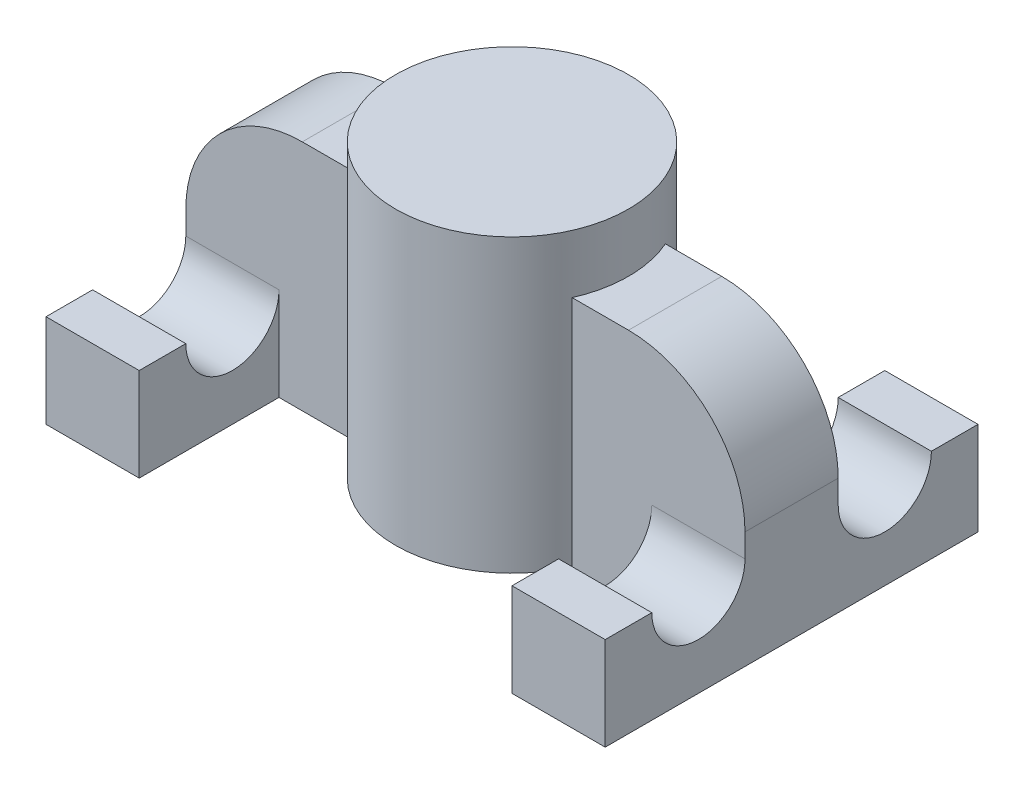
ISO-10303-21;
HEADER;
FILE_DESCRIPTION(('STEP AP214'),'2;1');
FILE_NAME('part.step','',(''),(''),'','','');
FILE_SCHEMA(('AUTOMOTIVE_DESIGN { 1 0 10303 214 1 1 1 1 }'));
ENDSEC;
DATA;
#1=APPLICATION_CONTEXT('core data for automotive mechanical design processes');
#2=APPLICATION_PROTOCOL_DEFINITION('international standard','automotive_design',2000,#1);
#3=PRODUCT_CONTEXT('',#1,'mechanical');
#4=PRODUCT('Part','Part','',(#3));
#5=PRODUCT_RELATED_PRODUCT_CATEGORY('part','',(#4));
#6=PRODUCT_DEFINITION_FORMATION('','',#4);
#7=PRODUCT_DEFINITION_CONTEXT('part definition',#1,'design');
#8=PRODUCT_DEFINITION('design','',#6,#7);
#9=PRODUCT_DEFINITION_SHAPE('','',#8);
#10=(LENGTH_UNIT() NAMED_UNIT(*) SI_UNIT(.MILLI.,.METRE.));
#11=(NAMED_UNIT(*) PLANE_ANGLE_UNIT() SI_UNIT($,.RADIAN.));
#12=(NAMED_UNIT(*) SI_UNIT($,.STERADIAN.) SOLID_ANGLE_UNIT());
#13=UNCERTAINTY_MEASURE_WITH_UNIT(LENGTH_MEASURE(1.E-05),#10,'distance_accuracy_value','');
#14=(GEOMETRIC_REPRESENTATION_CONTEXT(3) GLOBAL_UNCERTAINTY_ASSIGNED_CONTEXT((#13)) GLOBAL_UNIT_ASSIGNED_CONTEXT((#10,
#11,#12)) REPRESENTATION_CONTEXT('',''));
#15=CARTESIAN_POINT('',(0.,0.,0.));
#16=DIRECTION('',(0.,0.,1.));
#17=DIRECTION('',(1.,0.,0.));
#18=AXIS2_PLACEMENT_3D('',#15,#16,#17);
#19=CARTESIAN_POINT('',(-24.,20.,-4.));
#20=DIRECTION('',(0.,0.,-1.));
#21=DIRECTION('',(-1.,0.,0.));
#22=AXIS2_PLACEMENT_3D('',#19,#20,#21);
#23=PLANE('',#22);
#24=DIRECTION('',(0.,-1.,0.));
#25=VECTOR('',#24,1.);
#26=CARTESIAN_POINT('',(-24.,20.,-4.));
#27=LINE('',#26,#25);
#28=CARTESIAN_POINT('',(-24.,10.,-4.));
#29=VERTEX_POINT('',#28);
#30=CARTESIAN_POINT('',(-24.,8.,-4.));
#31=VERTEX_POINT('',#30);
#32=EDGE_CURVE('E363',#29,#31,#27,.T.);
#33=ORIENTED_EDGE('',*,*,#32,.F.);
#34=CARTESIAN_POINT('',(-14.,10.,-4.));
#35=DIRECTION('',(0.,0.,-1.));
#36=DIRECTION('',(-1.,0.,0.));
#37=AXIS2_PLACEMENT_3D('',#34,#35,#36);
#38=CIRCLE('',#37,10.);
#39=CARTESIAN_POINT('',(-14.,20.,-4.));
#40=VERTEX_POINT('',#39);
#41=EDGE_CURVE('E57',#29,#40,#38,.T.);
#42=ORIENTED_EDGE('',*,*,#41,.T.);
#43=DIRECTION('',(1.,0.,0.));
#44=VECTOR('',#43,1.);
#45=CARTESIAN_POINT('',(-24.,20.,-4.));
#46=LINE('',#45,#44);
#47=CARTESIAN_POINT('',(-9.16515138991168,20.,-4.));
#48=VERTEX_POINT('',#47);
#49=EDGE_CURVE('E357',#40,#48,#46,.T.);
#50=ORIENTED_EDGE('',*,*,#49,.T.);
#51=DIRECTION('',(0.,-1.,0.));
#52=VECTOR('',#51,1.);
#53=CARTESIAN_POINT('',(-9.16515138991168,25.,-4.));
#54=LINE('',#53,#52);
#55=CARTESIAN_POINT('',(-9.16515138991168,0.,-4.));
#56=VERTEX_POINT('',#55);
#57=EDGE_CURVE('E375',#56,#48,#54,.F.);
#58=ORIENTED_EDGE('',*,*,#57,.F.);
#59=DIRECTION('',(1.,0.,0.));
#60=VECTOR('',#59,1.);
#61=CARTESIAN_POINT('',(-24.,0.,-4.));
#62=LINE('',#61,#60);
#63=CARTESIAN_POINT('',(-16.,0.,-4.));
#64=VERTEX_POINT('',#63);
#65=EDGE_CURVE('E366',#64,#56,#62,.T.);
#66=ORIENTED_EDGE('',*,*,#65,.F.);
#67=DIRECTION('',(0.,-1.,0.));
#68=VECTOR('',#67,1.);
#69=CARTESIAN_POINT('',(-16.,8.,-4.));
#70=LINE('',#69,#68);
#71=CARTESIAN_POINT('',(-16.,8.,-4.));
#72=VERTEX_POINT('',#71);
#73=EDGE_CURVE('E230',#72,#64,#70,.T.);
#74=ORIENTED_EDGE('',*,*,#73,.F.);
#75=DIRECTION('',(-1.,0.,0.));
#76=VECTOR('',#75,1.);
#77=CARTESIAN_POINT('',(-16.,8.,-4.));
#78=LINE('',#77,#76);
#79=EDGE_CURVE('E234',#72,#31,#78,.T.);
#80=ORIENTED_EDGE('',*,*,#79,.T.);
#81=EDGE_LOOP('',(#33,#42,#50,#58,#66,#74,#80));
#82=FACE_BOUND('',#81,.T.);
#83=ADVANCED_FACE('F35',(#82),#23,.T.);
#84=CARTESIAN_POINT('',(9.16515138991168,20.,-4.));
#85=VERTEX_POINT('',#84);
#86=CARTESIAN_POINT('',(14.,20.,-4.));
#87=VERTEX_POINT('',#86);
#88=EDGE_CURVE('E360',#85,#87,#46,.T.);
#89=ORIENTED_EDGE('',*,*,#88,.T.);
#90=CARTESIAN_POINT('',(14.,10.,-4.));
#91=DIRECTION('',(0.,0.,-1.));
#92=DIRECTION('',(-1.,0.,0.));
#93=AXIS2_PLACEMENT_3D('',#90,#91,#92);
#94=CIRCLE('',#93,10.);
#95=CARTESIAN_POINT('',(24.,10.,-4.));
#96=VERTEX_POINT('',#95);
#97=EDGE_CURVE('E410',#87,#96,#94,.T.);
#98=ORIENTED_EDGE('',*,*,#97,.T.);
#99=DIRECTION('',(0.,-1.,0.));
#100=VECTOR('',#99,1.);
#101=CARTESIAN_POINT('',(24.,20.,-4.));
#102=LINE('',#101,#100);
#103=CARTESIAN_POINT('',(24.,8.,-4.));
#104=VERTEX_POINT('',#103);
#105=EDGE_CURVE('E378',#96,#104,#102,.T.);
#106=ORIENTED_EDGE('',*,*,#105,.T.);
#107=DIRECTION('',(1.,0.,0.));
#108=VECTOR('',#107,1.);
#109=CARTESIAN_POINT('',(16.,8.,-4.));
#110=LINE('',#109,#108);
#111=CARTESIAN_POINT('',(16.,8.,-4.));
#112=VERTEX_POINT('',#111);
#113=EDGE_CURVE('E299',#112,#104,#110,.T.);
#114=ORIENTED_EDGE('',*,*,#113,.F.);
#115=DIRECTION('',(0.,-1.,0.));
#116=VECTOR('',#115,1.);
#117=CARTESIAN_POINT('',(16.,8.,-4.));
#118=LINE('',#117,#116);
#119=CARTESIAN_POINT('',(16.,0.,-4.));
#120=VERTEX_POINT('',#119);
#121=EDGE_CURVE('E287',#112,#120,#118,.T.);
#122=ORIENTED_EDGE('',*,*,#121,.T.);
#123=CARTESIAN_POINT('',(9.16515138991168,0.,-4.));
#124=VERTEX_POINT('',#123);
#125=EDGE_CURVE('E365',#124,#120,#62,.T.);
#126=ORIENTED_EDGE('',*,*,#125,.F.);
#127=DIRECTION('',(0.,-1.,0.));
#128=VECTOR('',#127,1.);
#129=CARTESIAN_POINT('',(9.16515138991168,25.,-4.));
#130=LINE('',#129,#128);
#131=EDGE_CURVE('E383',#85,#124,#130,.T.);
#132=ORIENTED_EDGE('',*,*,#131,.F.);
#133=EDGE_LOOP('',(#89,#98,#106,#114,#122,#126,#132));
#134=FACE_BOUND('',#133,.T.);
#135=ADVANCED_FACE('F461',(#134),#23,.T.);
#136=CARTESIAN_POINT('',(0.,25.,0.));
#137=DIRECTION('',(0.,-1.,0.));
#138=DIRECTION('',(0.,0.,-1.));
#139=AXIS2_PLACEMENT_3D('',#136,#137,#138);
#140=CYLINDRICAL_SURFACE('',#139,10.);
#141=CARTESIAN_POINT('',(0.,0.,0.));
#142=DIRECTION('',(0.,1.,0.));
#143=DIRECTION('',(0.,0.,1.));
#144=AXIS2_PLACEMENT_3D('',#141,#142,#143);
#145=CIRCLE('',#144,10.);
#146=CARTESIAN_POINT('',(-9.16515138991168,0.,4.));
#147=VERTEX_POINT('',#146);
#148=CARTESIAN_POINT('',(9.16515138991168,0.,4.));
#149=VERTEX_POINT('',#148);
#150=EDGE_CURVE('E392',#147,#149,#145,.T.);
#151=ORIENTED_EDGE('',*,*,#150,.T.);
#152=DIRECTION('',(0.,-1.,0.));
#153=VECTOR('',#152,1.);
#154=CARTESIAN_POINT('',(9.16515138991168,25.,4.));
#155=LINE('',#154,#153);
#156=CARTESIAN_POINT('',(9.16515138991168,20.,4.));
#157=VERTEX_POINT('',#156);
#158=EDGE_CURVE('E386',#149,#157,#155,.F.);
#159=ORIENTED_EDGE('',*,*,#158,.T.);
#160=CARTESIAN_POINT('',(0.,20.,0.));
#161=DIRECTION('',(0.,-1.,0.));
#162=DIRECTION('',(0.,0.,-1.));
#163=AXIS2_PLACEMENT_3D('',#160,#161,#162);
#164=CIRCLE('',#163,10.);
#165=EDGE_CURVE('E402',#85,#157,#164,.T.);
#166=ORIENTED_EDGE('',*,*,#165,.F.);
#167=ORIENTED_EDGE('',*,*,#131,.T.);
#168=EDGE_CURVE('E397',#124,#56,#145,.T.);
#169=ORIENTED_EDGE('',*,*,#168,.T.);
#170=ORIENTED_EDGE('',*,*,#57,.T.);
#171=CARTESIAN_POINT('',(-9.16515138991168,20.,4.));
#172=VERTEX_POINT('',#171);
#173=EDGE_CURVE('E396',#172,#48,#164,.T.);
#174=ORIENTED_EDGE('',*,*,#173,.F.);
#175=DIRECTION('',(0.,-1.,0.));
#176=VECTOR('',#175,1.);
#177=CARTESIAN_POINT('',(-9.16515138991168,25.,4.));
#178=LINE('',#177,#176);
#179=EDGE_CURVE('E389',#172,#147,#178,.T.);
#180=ORIENTED_EDGE('',*,*,#179,.T.);
#181=EDGE_LOOP('',(#151,#159,#166,#167,#169,#170,#174,#180));
#182=FACE_BOUND('',#181,.T.);
#183=CARTESIAN_POINT('',(0.,25.,0.));
#184=DIRECTION('',(0.,1.,0.));
#185=DIRECTION('',(0.,0.,1.));
#186=AXIS2_PLACEMENT_3D('',#183,#184,#185);
#187=CIRCLE('',#186,10.);
#188=CARTESIAN_POINT('',(0.,25.,10.));
#189=VERTEX_POINT('',#188);
#190=EDGE_CURVE('E393',#189,#189,#187,.T.);
#191=ORIENTED_EDGE('',*,*,#190,.F.);
#192=EDGE_LOOP('',(#191));
#193=FACE_BOUND('',#192,.T.);
#194=ADVANCED_FACE('F466',(#182,#193),#140,.T.);
#195=CARTESIAN_POINT('',(0.,25.,0.));
#196=DIRECTION('',(0.,1.,0.));
#197=DIRECTION('',(0.,0.,1.));
#198=AXIS2_PLACEMENT_3D('',#195,#196,#197);
#199=PLANE('',#198);
#200=ORIENTED_EDGE('',*,*,#190,.T.);
#201=EDGE_LOOP('',(#200));
#202=FACE_BOUND('',#201,.T.);
#203=ADVANCED_FACE('F475',(#202),#199,.T.);
#204=CARTESIAN_POINT('',(0.,0.,0.));
#205=DIRECTION('',(0.,1.,0.));
#206=DIRECTION('',(0.,0.,1.));
#207=AXIS2_PLACEMENT_3D('',#204,#205,#206);
#208=PLANE('',#207);
#209=CARTESIAN_POINT('',(0.,0.,0.));
#210=DIRECTION('',(0.,-1.,0.));
#211=DIRECTION('',(0.,0.,-1.));
#212=AXIS2_PLACEMENT_3D('',#209,#210,#211);
#213=CIRCLE('',#212,6.25);
#214=CARTESIAN_POINT('',(0.,0.,-6.25));
#215=VERTEX_POINT('',#214);
#216=EDGE_CURVE('E344',#215,#215,#213,.T.);
#217=ORIENTED_EDGE('',*,*,#216,.F.);
#218=EDGE_LOOP('',(#217));
#219=FACE_BOUND('',#218,.T.);
#220=ORIENTED_EDGE('',*,*,#168,.F.);
#221=ORIENTED_EDGE('',*,*,#125,.T.);
#222=DIRECTION('',(0.,0.,-1.));
#223=VECTOR('',#222,1.);
#224=CARTESIAN_POINT('',(16.,0.,-4.));
#225=LINE('',#224,#223);
#226=CARTESIAN_POINT('',(16.,0.,-16.));
#227=VERTEX_POINT('',#226);
#228=EDGE_CURVE('E290',#120,#227,#225,.T.);
#229=ORIENTED_EDGE('',*,*,#228,.T.);
#230=DIRECTION('',(1.,0.,0.));
#231=VECTOR('',#230,1.);
#232=CARTESIAN_POINT('',(16.,0.,-16.));
#233=LINE('',#232,#231);
#234=CARTESIAN_POINT('',(24.,0.,-16.));
#235=VERTEX_POINT('',#234);
#236=EDGE_CURVE('E312',#227,#235,#233,.T.);
#237=ORIENTED_EDGE('',*,*,#236,.T.);
#238=DIRECTION('',(0.,0.,1.));
#239=VECTOR('',#238,1.);
#240=CARTESIAN_POINT('',(24.,0.,4.));
#241=LINE('',#240,#239);
#242=CARTESIAN_POINT('',(24.,0.,16.));
#243=VERTEX_POINT('',#242);
#244=EDGE_CURVE('E368',#235,#243,#241,.T.);
#245=ORIENTED_EDGE('',*,*,#244,.T.);
#246=DIRECTION('',(1.,0.,0.));
#247=VECTOR('',#246,1.);
#248=CARTESIAN_POINT('',(16.,0.,16.));
#249=LINE('',#248,#247);
#250=CARTESIAN_POINT('',(16.,0.,16.));
#251=VERTEX_POINT('',#250);
#252=EDGE_CURVE('E341',#251,#243,#249,.T.);
#253=ORIENTED_EDGE('',*,*,#252,.F.);
#254=DIRECTION('',(0.,0.,-1.));
#255=VECTOR('',#254,1.);
#256=CARTESIAN_POINT('',(16.,0.,4.));
#257=LINE('',#256,#255);
#258=CARTESIAN_POINT('',(16.,0.,4.));
#259=VERTEX_POINT('',#258);
#260=EDGE_CURVE('E330',#251,#259,#257,.T.);
#261=ORIENTED_EDGE('',*,*,#260,.T.);
#262=DIRECTION('',(-1.,0.,0.));
#263=VECTOR('',#262,1.);
#264=CARTESIAN_POINT('',(-24.,0.,4.));
#265=LINE('',#264,#263);
#266=EDGE_CURVE('E371',#259,#149,#265,.T.);
#267=ORIENTED_EDGE('',*,*,#266,.T.);
#268=ORIENTED_EDGE('',*,*,#150,.F.);
#269=CARTESIAN_POINT('',(-16.,0.,4.));
#270=VERTEX_POINT('',#269);
#271=EDGE_CURVE('E370',#147,#270,#265,.T.);
#272=ORIENTED_EDGE('',*,*,#271,.T.);
#273=DIRECTION('',(0.,0.,-1.));
#274=VECTOR('',#273,1.);
#275=CARTESIAN_POINT('',(-16.,0.,4.));
#276=LINE('',#275,#274);
#277=CARTESIAN_POINT('',(-16.,0.,16.));
#278=VERTEX_POINT('',#277);
#279=EDGE_CURVE('E256',#278,#270,#276,.T.);
#280=ORIENTED_EDGE('',*,*,#279,.F.);
#281=DIRECTION('',(-1.,0.,0.));
#282=VECTOR('',#281,1.);
#283=CARTESIAN_POINT('',(-16.,0.,16.));
#284=LINE('',#283,#282);
#285=CARTESIAN_POINT('',(-24.,0.,16.));
#286=VERTEX_POINT('',#285);
#287=EDGE_CURVE('E266',#278,#286,#284,.T.);
#288=ORIENTED_EDGE('',*,*,#287,.T.);
#289=DIRECTION('',(0.,0.,-1.));
#290=VECTOR('',#289,1.);
#291=CARTESIAN_POINT('',(-24.,0.,4.));
#292=LINE('',#291,#290);
#293=CARTESIAN_POINT('',(-24.,0.,-16.));
#294=VERTEX_POINT('',#293);
#295=EDGE_CURVE('E356',#286,#294,#292,.T.);
#296=ORIENTED_EDGE('',*,*,#295,.T.);
#297=DIRECTION('',(-1.,0.,0.));
#298=VECTOR('',#297,1.);
#299=CARTESIAN_POINT('',(-16.,0.,-16.));
#300=LINE('',#299,#298);
#301=CARTESIAN_POINT('',(-16.,0.,-16.));
#302=VERTEX_POINT('',#301);
#303=EDGE_CURVE('E249',#302,#294,#300,.T.);
#304=ORIENTED_EDGE('',*,*,#303,.F.);
#305=DIRECTION('',(0.,0.,-1.));
#306=VECTOR('',#305,1.);
#307=CARTESIAN_POINT('',(-16.,0.,-4.));
#308=LINE('',#307,#306);
#309=EDGE_CURVE('E241',#64,#302,#308,.T.);
#310=ORIENTED_EDGE('',*,*,#309,.F.);
#311=ORIENTED_EDGE('',*,*,#65,.T.);
#312=EDGE_LOOP('',(#220,#221,#229,#237,#245,#253,#261,#267,#268,#272,#280,#288,#296,#304,#310,#311));
#313=FACE_BOUND('',#312,.T.);
#314=ADVANCED_FACE('F427',(#219,#313),#208,.F.);
#315=CARTESIAN_POINT('',(-24.,20.,4.));
#316=DIRECTION('',(-1.,0.,0.));
#317=DIRECTION('',(0.,0.,1.));
#318=AXIS2_PLACEMENT_3D('',#315,#316,#317);
#319=PLANE('',#318);
#320=DIRECTION('',(0.,-1.,0.));
#321=VECTOR('',#320,1.);
#322=CARTESIAN_POINT('',(-24.,20.,4.));
#323=LINE('',#322,#321);
#324=CARTESIAN_POINT('',(-24.,10.,4.));
#325=VERTEX_POINT('',#324);
#326=CARTESIAN_POINT('',(-24.,8.,4.));
#327=VERTEX_POINT('',#326);
#328=EDGE_CURVE('E373',#325,#327,#323,.T.);
#329=ORIENTED_EDGE('',*,*,#328,.F.);
#330=DIRECTION('',(0.,0.,-1.));
#331=VECTOR('',#330,1.);
#332=CARTESIAN_POINT('',(-24.,10.,-4.));
#333=LINE('',#332,#331);
#334=EDGE_CURVE('E412',#325,#29,#333,.T.);
#335=ORIENTED_EDGE('',*,*,#334,.T.);
#336=ORIENTED_EDGE('',*,*,#32,.T.);
#337=CARTESIAN_POINT('',(-24.,8.,-8.));
#338=DIRECTION('',(-1.,0.,0.));
#339=DIRECTION('',(0.,0.,1.));
#340=AXIS2_PLACEMENT_3D('',#337,#338,#339);
#341=CIRCLE('',#340,4.);
#342=CARTESIAN_POINT('',(-24.,8.,-12.));
#343=VERTEX_POINT('',#342);
#344=EDGE_CURVE('E244',#343,#31,#341,.T.);
#345=ORIENTED_EDGE('',*,*,#344,.F.);
#346=DIRECTION('',(0.,0.,1.));
#347=VECTOR('',#346,1.);
#348=CARTESIAN_POINT('',(-24.,8.,-16.));
#349=LINE('',#348,#347);
#350=CARTESIAN_POINT('',(-24.,8.,-16.));
#351=VERTEX_POINT('',#350);
#352=EDGE_CURVE('E225',#351,#343,#349,.T.);
#353=ORIENTED_EDGE('',*,*,#352,.F.);
#354=DIRECTION('',(0.,1.,0.));
#355=VECTOR('',#354,1.);
#356=CARTESIAN_POINT('',(-24.,0.,-16.));
#357=LINE('',#356,#355);
#358=EDGE_CURVE('E236',#294,#351,#357,.T.);
#359=ORIENTED_EDGE('',*,*,#358,.F.);
#360=ORIENTED_EDGE('',*,*,#295,.F.);
#361=DIRECTION('',(0.,-1.,0.));
#362=VECTOR('',#361,1.);
#363=CARTESIAN_POINT('',(-24.,0.,16.));
#364=LINE('',#363,#362);
#365=CARTESIAN_POINT('',(-24.,8.,16.));
#366=VERTEX_POINT('',#365);
#367=EDGE_CURVE('E248',#366,#286,#364,.T.);
#368=ORIENTED_EDGE('',*,*,#367,.F.);
#369=DIRECTION('',(0.,0.,1.));
#370=VECTOR('',#369,1.);
#371=CARTESIAN_POINT('',(-24.,8.,16.));
#372=LINE('',#371,#370);
#373=CARTESIAN_POINT('',(-24.,8.,12.));
#374=VERTEX_POINT('',#373);
#375=EDGE_CURVE('E269',#374,#366,#372,.T.);
#376=ORIENTED_EDGE('',*,*,#375,.F.);
#377=CARTESIAN_POINT('',(-24.,8.,8.));
#378=DIRECTION('',(-1.,0.,0.));
#379=DIRECTION('',(0.,0.,-1.));
#380=AXIS2_PLACEMENT_3D('',#377,#378,#379);
#381=CIRCLE('',#380,4.);
#382=EDGE_CURVE('E257',#327,#374,#381,.T.);
#383=ORIENTED_EDGE('',*,*,#382,.F.);
#384=EDGE_LOOP('',(#329,#335,#336,#345,#353,#359,#360,#368,#376,#383));
#385=FACE_BOUND('',#384,.T.);
#386=ADVANCED_FACE('F418',(#385),#319,.T.);
#387=CARTESIAN_POINT('',(-24.,20.,-4.));
#388=DIRECTION('',(0.,-1.,0.));
#389=DIRECTION('',(0.,0.,-1.));
#390=AXIS2_PLACEMENT_3D('',#387,#388,#389);
#391=PLANE('',#390);
#392=ORIENTED_EDGE('',*,*,#49,.F.);
#393=DIRECTION('',(0.,0.,-1.));
#394=VECTOR('',#393,1.);
#395=CARTESIAN_POINT('',(-14.,20.,4.));
#396=LINE('',#395,#394);
#397=CARTESIAN_POINT('',(-14.,20.,4.));
#398=VERTEX_POINT('',#397);
#399=EDGE_CURVE('E43',#40,#398,#396,.F.);
#400=ORIENTED_EDGE('',*,*,#399,.T.);
#401=DIRECTION('',(-1.,0.,0.));
#402=VECTOR('',#401,1.);
#403=CARTESIAN_POINT('',(-24.,20.,4.));
#404=LINE('',#403,#402);
#405=EDGE_CURVE('E359',#172,#398,#404,.T.);
#406=ORIENTED_EDGE('',*,*,#405,.F.);
#407=ORIENTED_EDGE('',*,*,#173,.T.);
#408=EDGE_LOOP('',(#392,#400,#406,#407));
#409=FACE_BOUND('',#408,.T.);
#410=ADVANCED_FACE('F474',(#409),#391,.F.);
#411=CARTESIAN_POINT('',(-24.,20.,4.));
#412=DIRECTION('',(0.,0.,1.));
#413=DIRECTION('',(1.,0.,0.));
#414=AXIS2_PLACEMENT_3D('',#411,#412,#413);
#415=PLANE('',#414);
#416=ORIENTED_EDGE('',*,*,#405,.T.);
#417=CARTESIAN_POINT('',(-14.,10.,4.));
#418=DIRECTION('',(0.,0.,1.));
#419=DIRECTION('',(1.,0.,0.));
#420=AXIS2_PLACEMENT_3D('',#417,#418,#419);
#421=CIRCLE('',#420,10.);
#422=EDGE_CURVE('E11',#398,#325,#421,.T.);
#423=ORIENTED_EDGE('',*,*,#422,.T.);
#424=ORIENTED_EDGE('',*,*,#328,.T.);
#425=DIRECTION('',(-1.,0.,0.));
#426=VECTOR('',#425,1.);
#427=CARTESIAN_POINT('',(-16.,8.,4.));
#428=LINE('',#427,#426);
#429=CARTESIAN_POINT('',(-16.,8.,4.));
#430=VERTEX_POINT('',#429);
#431=EDGE_CURVE('E272',#430,#327,#428,.T.);
#432=ORIENTED_EDGE('',*,*,#431,.F.);
#433=DIRECTION('',(0.,1.,0.));
#434=VECTOR('',#433,1.);
#435=CARTESIAN_POINT('',(-16.,8.,4.));
#436=LINE('',#435,#434);
#437=EDGE_CURVE('E253',#270,#430,#436,.T.);
#438=ORIENTED_EDGE('',*,*,#437,.F.);
#439=ORIENTED_EDGE('',*,*,#271,.F.);
#440=ORIENTED_EDGE('',*,*,#179,.F.);
#441=EDGE_LOOP('',(#416,#423,#424,#432,#438,#439,#440));
#442=FACE_BOUND('',#441,.T.);
#443=ADVANCED_FACE('F452',(#442),#415,.T.);
#444=CARTESIAN_POINT('',(14.,20.,4.));
#445=VERTEX_POINT('',#444);
#446=EDGE_CURVE('E361',#445,#157,#404,.T.);
#447=ORIENTED_EDGE('',*,*,#446,.F.);
#448=DIRECTION('',(0.,0.,1.));
#449=VECTOR('',#448,1.);
#450=CARTESIAN_POINT('',(14.,20.,-4.));
#451=LINE('',#450,#449);
#452=EDGE_CURVE('E408',#445,#87,#451,.F.);
#453=ORIENTED_EDGE('',*,*,#452,.T.);
#454=ORIENTED_EDGE('',*,*,#88,.F.);
#455=ORIENTED_EDGE('',*,*,#165,.T.);
#456=EDGE_LOOP('',(#447,#453,#454,#455));
#457=FACE_BOUND('',#456,.T.);
#458=ADVANCED_FACE('F497',(#457),#391,.F.);
#459=DIRECTION('',(0.,-1.,0.));
#460=VECTOR('',#459,1.);
#461=CARTESIAN_POINT('',(24.,20.,4.));
#462=LINE('',#461,#460);
#463=CARTESIAN_POINT('',(24.,10.,4.));
#464=VERTEX_POINT('',#463);
#465=CARTESIAN_POINT('',(24.,8.,4.));
#466=VERTEX_POINT('',#465);
#467=EDGE_CURVE('E376',#464,#466,#462,.T.);
#468=ORIENTED_EDGE('',*,*,#467,.F.);
#469=CARTESIAN_POINT('',(14.,10.,4.));
#470=DIRECTION('',(0.,0.,1.));
#471=DIRECTION('',(1.,0.,0.));
#472=AXIS2_PLACEMENT_3D('',#469,#470,#471);
#473=CIRCLE('',#472,10.);
#474=EDGE_CURVE('E406',#464,#445,#473,.T.);
#475=ORIENTED_EDGE('',*,*,#474,.T.);
#476=ORIENTED_EDGE('',*,*,#446,.T.);
#477=ORIENTED_EDGE('',*,*,#158,.F.);
#478=ORIENTED_EDGE('',*,*,#266,.F.);
#479=DIRECTION('',(0.,1.,0.));
#480=VECTOR('',#479,1.);
#481=CARTESIAN_POINT('',(16.,8.,4.));
#482=LINE('',#481,#480);
#483=CARTESIAN_POINT('',(16.,8.,4.));
#484=VERTEX_POINT('',#483);
#485=EDGE_CURVE('E317',#259,#484,#482,.T.);
#486=ORIENTED_EDGE('',*,*,#485,.T.);
#487=DIRECTION('',(1.,0.,0.));
#488=VECTOR('',#487,1.);
#489=CARTESIAN_POINT('',(16.,8.,4.));
#490=LINE('',#489,#488);
#491=EDGE_CURVE('E333',#484,#466,#490,.T.);
#492=ORIENTED_EDGE('',*,*,#491,.T.);
#493=EDGE_LOOP('',(#468,#475,#476,#477,#478,#486,#492));
#494=FACE_BOUND('',#493,.T.);
#495=ADVANCED_FACE('F493',(#494),#415,.T.);
#496=CARTESIAN_POINT('',(24.,20.,4.));
#497=DIRECTION('',(1.,0.,0.));
#498=DIRECTION('',(0.,0.,-1.));
#499=AXIS2_PLACEMENT_3D('',#496,#497,#498);
#500=PLANE('',#499);
#501=ORIENTED_EDGE('',*,*,#105,.F.);
#502=DIRECTION('',(0.,0.,1.));
#503=VECTOR('',#502,1.);
#504=CARTESIAN_POINT('',(24.,10.,4.));
#505=LINE('',#504,#503);
#506=EDGE_CURVE('E403',#96,#464,#505,.T.);
#507=ORIENTED_EDGE('',*,*,#506,.T.);
#508=ORIENTED_EDGE('',*,*,#467,.T.);
#509=CARTESIAN_POINT('',(24.,8.,8.));
#510=DIRECTION('',(-1.,0.,0.));
#511=DIRECTION('',(0.,0.,-1.));
#512=AXIS2_PLACEMENT_3D('',#509,#510,#511);
#513=CIRCLE('',#512,4.);
#514=CARTESIAN_POINT('',(24.,8.,12.));
#515=VERTEX_POINT('',#514);
#516=EDGE_CURVE('E309',#466,#515,#513,.T.);
#517=ORIENTED_EDGE('',*,*,#516,.T.);
#518=DIRECTION('',(0.,0.,1.));
#519=VECTOR('',#518,1.);
#520=CARTESIAN_POINT('',(24.,8.,16.));
#521=LINE('',#520,#519);
#522=CARTESIAN_POINT('',(24.,8.,16.));
#523=VERTEX_POINT('',#522);
#524=EDGE_CURVE('E336',#515,#523,#521,.T.);
#525=ORIENTED_EDGE('',*,*,#524,.T.);
#526=DIRECTION('',(0.,-1.,0.));
#527=VECTOR('',#526,1.);
#528=CARTESIAN_POINT('',(24.,0.,16.));
#529=LINE('',#528,#527);
#530=EDGE_CURVE('E321',#523,#243,#529,.T.);
#531=ORIENTED_EDGE('',*,*,#530,.T.);
#532=ORIENTED_EDGE('',*,*,#244,.F.);
#533=DIRECTION('',(0.,1.,0.));
#534=VECTOR('',#533,1.);
#535=CARTESIAN_POINT('',(24.,0.,-16.));
#536=LINE('',#535,#534);
#537=CARTESIAN_POINT('',(24.,8.,-16.));
#538=VERTEX_POINT('',#537);
#539=EDGE_CURVE('E302',#235,#538,#536,.T.);
#540=ORIENTED_EDGE('',*,*,#539,.T.);
#541=DIRECTION('',(0.,0.,1.));
#542=VECTOR('',#541,1.);
#543=CARTESIAN_POINT('',(24.,8.,-16.));
#544=LINE('',#543,#542);
#545=CARTESIAN_POINT('',(24.,8.,-12.));
#546=VERTEX_POINT('',#545);
#547=EDGE_CURVE('E288',#538,#546,#544,.T.);
#548=ORIENTED_EDGE('',*,*,#547,.T.);
#549=CARTESIAN_POINT('',(24.,8.,-8.));
#550=DIRECTION('',(-1.,0.,0.));
#551=DIRECTION('',(0.,0.,1.));
#552=AXIS2_PLACEMENT_3D('',#549,#550,#551);
#553=CIRCLE('',#552,4.);
#554=EDGE_CURVE('E275',#546,#104,#553,.T.);
#555=ORIENTED_EDGE('',*,*,#554,.T.);
#556=EDGE_LOOP('',(#501,#507,#508,#517,#525,#531,#532,#540,#548,#555));
#557=FACE_BOUND('',#556,.T.);
#558=ADVANCED_FACE('F470',(#557),#500,.T.);
#559=CARTESIAN_POINT('',(0.,15.,0.));
#560=DIRECTION('',(0.,-1.,0.));
#561=DIRECTION('',(0.,0.,-1.));
#562=AXIS2_PLACEMENT_3D('',#559,#560,#561);
#563=CONICAL_SURFACE('',#562,6.25,0.78539816339745);
#564=CARTESIAN_POINT('',(0.,21.25,0.));
#565=VERTEX_POINT('',#564);
#566=VERTEX_LOOP('',#565);
#567=FACE_BOUND('',#566,.T.);
#568=CARTESIAN_POINT('',(0.,15.,0.));
#569=DIRECTION('',(0.,-1.,0.));
#570=DIRECTION('',(0.,0.,-1.));
#571=AXIS2_PLACEMENT_3D('',#568,#569,#570);
#572=CIRCLE('',#571,6.25);
#573=CARTESIAN_POINT('',(0.,15.,-6.25));
#574=VERTEX_POINT('',#573);
#575=EDGE_CURVE('E353',#574,#574,#572,.T.);
#576=ORIENTED_EDGE('',*,*,#575,.T.);
#577=EDGE_LOOP('',(#576));
#578=FACE_BOUND('',#577,.T.);
#579=ADVANCED_FACE('F532',(#567,#578),#563,.F.);
#580=CARTESIAN_POINT('',(0.,0.,0.));
#581=DIRECTION('',(0.,-1.,0.));
#582=DIRECTION('',(0.,0.,-1.));
#583=AXIS2_PLACEMENT_3D('',#580,#581,#582);
#584=CYLINDRICAL_SURFACE('',#583,6.25);
#585=ORIENTED_EDGE('',*,*,#575,.F.);
#586=EDGE_LOOP('',(#585));
#587=FACE_BOUND('',#586,.T.);
#588=ORIENTED_EDGE('',*,*,#216,.T.);
#589=EDGE_LOOP('',(#588));
#590=FACE_BOUND('',#589,.T.);
#591=ADVANCED_FACE('F536',(#587,#590),#584,.F.);
#592=CARTESIAN_POINT('',(16.,0.,16.));
#593=DIRECTION('',(0.,0.,1.));
#594=DIRECTION('',(1.,0.,0.));
#595=AXIS2_PLACEMENT_3D('',#592,#593,#594);
#596=PLANE('',#595);
#597=ORIENTED_EDGE('',*,*,#530,.F.);
#598=DIRECTION('',(1.,0.,0.));
#599=VECTOR('',#598,1.);
#600=CARTESIAN_POINT('',(16.,8.,16.));
#601=LINE('',#600,#599);
#602=CARTESIAN_POINT('',(16.,8.,16.));
#603=VERTEX_POINT('',#602);
#604=EDGE_CURVE('E345',#603,#523,#601,.T.);
#605=ORIENTED_EDGE('',*,*,#604,.F.);
#606=DIRECTION('',(0.,-1.,0.));
#607=VECTOR('',#606,1.);
#608=CARTESIAN_POINT('',(16.,0.,16.));
#609=LINE('',#608,#607);
#610=EDGE_CURVE('E327',#603,#251,#609,.T.);
#611=ORIENTED_EDGE('',*,*,#610,.T.);
#612=ORIENTED_EDGE('',*,*,#252,.T.);
#613=EDGE_LOOP('',(#597,#605,#611,#612));
#614=FACE_BOUND('',#613,.T.);
#615=ADVANCED_FACE('F541',(#614),#596,.T.);
#616=CARTESIAN_POINT('',(16.,8.,16.));
#617=DIRECTION('',(0.,1.,0.));
#618=DIRECTION('',(0.,0.,1.));
#619=AXIS2_PLACEMENT_3D('',#616,#617,#618);
#620=PLANE('',#619);
#621=ORIENTED_EDGE('',*,*,#524,.F.);
#622=DIRECTION('',(1.,0.,0.));
#623=VECTOR('',#622,1.);
#624=CARTESIAN_POINT('',(16.,8.,12.));
#625=LINE('',#624,#623);
#626=CARTESIAN_POINT('',(16.,8.,12.));
#627=VERTEX_POINT('',#626);
#628=EDGE_CURVE('E347',#627,#515,#625,.T.);
#629=ORIENTED_EDGE('',*,*,#628,.F.);
#630=DIRECTION('',(0.,0.,1.));
#631=VECTOR('',#630,1.);
#632=CARTESIAN_POINT('',(16.,8.,16.));
#633=LINE('',#632,#631);
#634=EDGE_CURVE('E324',#627,#603,#633,.T.);
#635=ORIENTED_EDGE('',*,*,#634,.T.);
#636=ORIENTED_EDGE('',*,*,#604,.T.);
#637=EDGE_LOOP('',(#621,#629,#635,#636));
#638=FACE_BOUND('',#637,.T.);
#639=ADVANCED_FACE('F550',(#638),#620,.T.);
#640=CARTESIAN_POINT('',(16.,8.,8.));
#641=DIRECTION('',(1.,0.,0.));
#642=DIRECTION('',(0.,0.,-1.));
#643=AXIS2_PLACEMENT_3D('',#640,#641,#642);
#644=CYLINDRICAL_SURFACE('',#643,4.);
#645=ORIENTED_EDGE('',*,*,#516,.F.);
#646=ORIENTED_EDGE('',*,*,#491,.F.);
#647=CARTESIAN_POINT('',(16.,8.,8.));
#648=DIRECTION('',(-1.,0.,0.));
#649=DIRECTION('',(0.,0.,-1.));
#650=AXIS2_PLACEMENT_3D('',#647,#648,#649);
#651=CIRCLE('',#650,4.);
#652=EDGE_CURVE('E320',#484,#627,#651,.T.);
#653=ORIENTED_EDGE('',*,*,#652,.T.);
#654=ORIENTED_EDGE('',*,*,#628,.T.);
#655=EDGE_LOOP('',(#645,#646,#653,#654));
#656=FACE_BOUND('',#655,.T.);
#657=ADVANCED_FACE('F546',(#656),#644,.F.);
#658=CARTESIAN_POINT('',(16.,8.,8.));
#659=DIRECTION('',(1.,0.,0.));
#660=DIRECTION('',(0.,0.,-1.));
#661=AXIS2_PLACEMENT_3D('',#658,#659,#660);
#662=PLANE('',#661);
#663=ORIENTED_EDGE('',*,*,#485,.F.);
#664=ORIENTED_EDGE('',*,*,#260,.F.);
#665=ORIENTED_EDGE('',*,*,#610,.F.);
#666=ORIENTED_EDGE('',*,*,#634,.F.);
#667=ORIENTED_EDGE('',*,*,#652,.F.);
#668=EDGE_LOOP('',(#663,#664,#665,#666,#667));
#669=FACE_BOUND('',#668,.T.);
#670=ADVANCED_FACE('F549',(#669),#662,.F.);
#671=CARTESIAN_POINT('',(16.,8.,-8.));
#672=DIRECTION('',(1.,0.,0.));
#673=DIRECTION('',(0.,0.,-1.));
#674=AXIS2_PLACEMENT_3D('',#671,#672,#673);
#675=CYLINDRICAL_SURFACE('',#674,4.);
#676=ORIENTED_EDGE('',*,*,#554,.F.);
#677=DIRECTION('',(1.,0.,0.));
#678=VECTOR('',#677,1.);
#679=CARTESIAN_POINT('',(16.,8.,-12.));
#680=LINE('',#679,#678);
#681=CARTESIAN_POINT('',(16.,8.,-12.));
#682=VERTEX_POINT('',#681);
#683=EDGE_CURVE('E307',#682,#546,#680,.T.);
#684=ORIENTED_EDGE('',*,*,#683,.F.);
#685=CARTESIAN_POINT('',(16.,8.,-8.));
#686=DIRECTION('',(-1.,0.,0.));
#687=DIRECTION('',(0.,0.,1.));
#688=AXIS2_PLACEMENT_3D('',#685,#686,#687);
#689=CIRCLE('',#688,4.);
#690=EDGE_CURVE('E284',#682,#112,#689,.T.);
#691=ORIENTED_EDGE('',*,*,#690,.T.);
#692=ORIENTED_EDGE('',*,*,#113,.T.);
#693=EDGE_LOOP('',(#676,#684,#691,#692));
#694=FACE_BOUND('',#693,.T.);
#695=ADVANCED_FACE('F508',(#694),#675,.F.);
#696=CARTESIAN_POINT('',(16.,8.,-16.));
#697=DIRECTION('',(0.,1.,0.));
#698=DIRECTION('',(0.,0.,1.));
#699=AXIS2_PLACEMENT_3D('',#696,#697,#698);
#700=PLANE('',#699);
#701=ORIENTED_EDGE('',*,*,#547,.F.);
#702=DIRECTION('',(1.,0.,0.));
#703=VECTOR('',#702,1.);
#704=CARTESIAN_POINT('',(16.,8.,-16.));
#705=LINE('',#704,#703);
#706=CARTESIAN_POINT('',(16.,8.,-16.));
#707=VERTEX_POINT('',#706);
#708=EDGE_CURVE('E310',#707,#538,#705,.T.);
#709=ORIENTED_EDGE('',*,*,#708,.F.);
#710=DIRECTION('',(0.,0.,1.));
#711=VECTOR('',#710,1.);
#712=CARTESIAN_POINT('',(16.,8.,-16.));
#713=LINE('',#712,#711);
#714=EDGE_CURVE('E296',#707,#682,#713,.T.);
#715=ORIENTED_EDGE('',*,*,#714,.T.);
#716=ORIENTED_EDGE('',*,*,#683,.T.);
#717=EDGE_LOOP('',(#701,#709,#715,#716));
#718=FACE_BOUND('',#717,.T.);
#719=ADVANCED_FACE('F563',(#718),#700,.T.);
#720=CARTESIAN_POINT('',(16.,0.,-16.));
#721=DIRECTION('',(0.,0.,-1.));
#722=DIRECTION('',(-1.,0.,0.));
#723=AXIS2_PLACEMENT_3D('',#720,#721,#722);
#724=PLANE('',#723);
#725=ORIENTED_EDGE('',*,*,#539,.F.);
#726=ORIENTED_EDGE('',*,*,#236,.F.);
#727=DIRECTION('',(0.,1.,0.));
#728=VECTOR('',#727,1.);
#729=CARTESIAN_POINT('',(16.,0.,-16.));
#730=LINE('',#729,#728);
#731=EDGE_CURVE('E293',#227,#707,#730,.T.);
#732=ORIENTED_EDGE('',*,*,#731,.T.);
#733=ORIENTED_EDGE('',*,*,#708,.T.);
#734=EDGE_LOOP('',(#725,#726,#732,#733));
#735=FACE_BOUND('',#734,.T.);
#736=ADVANCED_FACE('F564',(#735),#724,.T.);
#737=CARTESIAN_POINT('',(16.,8.,-8.));
#738=DIRECTION('',(-1.,0.,0.));
#739=DIRECTION('',(0.,0.,1.));
#740=AXIS2_PLACEMENT_3D('',#737,#738,#739);
#741=PLANE('',#740);
#742=ORIENTED_EDGE('',*,*,#690,.F.);
#743=ORIENTED_EDGE('',*,*,#714,.F.);
#744=ORIENTED_EDGE('',*,*,#731,.F.);
#745=ORIENTED_EDGE('',*,*,#228,.F.);
#746=ORIENTED_EDGE('',*,*,#121,.F.);
#747=EDGE_LOOP('',(#742,#743,#744,#745,#746));
#748=FACE_BOUND('',#747,.T.);
#749=ADVANCED_FACE('F515',(#748),#741,.T.);
#750=CARTESIAN_POINT('',(-16.,8.,8.));
#751=DIRECTION('',(-1.,0.,0.));
#752=DIRECTION('',(0.,0.,1.));
#753=AXIS2_PLACEMENT_3D('',#750,#751,#752);
#754=CYLINDRICAL_SURFACE('',#753,4.);
#755=ORIENTED_EDGE('',*,*,#382,.T.);
#756=DIRECTION('',(-1.,0.,0.));
#757=VECTOR('',#756,1.);
#758=CARTESIAN_POINT('',(-16.,8.,12.));
#759=LINE('',#758,#757);
#760=CARTESIAN_POINT('',(-16.,8.,12.));
#761=VERTEX_POINT('',#760);
#762=EDGE_CURVE('E276',#761,#374,#759,.T.);
#763=ORIENTED_EDGE('',*,*,#762,.F.);
#764=CARTESIAN_POINT('',(-16.,8.,8.));
#765=DIRECTION('',(-1.,0.,0.));
#766=DIRECTION('',(0.,0.,-1.));
#767=AXIS2_PLACEMENT_3D('',#764,#765,#766);
#768=CIRCLE('',#767,4.);
#769=EDGE_CURVE('E264',#430,#761,#768,.T.);
#770=ORIENTED_EDGE('',*,*,#769,.F.);
#771=ORIENTED_EDGE('',*,*,#431,.T.);
#772=EDGE_LOOP('',(#755,#763,#770,#771));
#773=FACE_BOUND('',#772,.T.);
#774=ADVANCED_FACE('F450',(#773),#754,.F.);
#775=CARTESIAN_POINT('',(-16.,8.,16.));
#776=DIRECTION('',(0.,-1.,0.));
#777=DIRECTION('',(0.,0.,-1.));
#778=AXIS2_PLACEMENT_3D('',#775,#776,#777);
#779=PLANE('',#778);
#780=ORIENTED_EDGE('',*,*,#375,.T.);
#781=DIRECTION('',(-1.,0.,0.));
#782=VECTOR('',#781,1.);
#783=CARTESIAN_POINT('',(-16.,8.,16.));
#784=LINE('',#783,#782);
#785=CARTESIAN_POINT('',(-16.,8.,16.));
#786=VERTEX_POINT('',#785);
#787=EDGE_CURVE('E279',#786,#366,#784,.T.);
#788=ORIENTED_EDGE('',*,*,#787,.F.);
#789=DIRECTION('',(0.,0.,1.));
#790=VECTOR('',#789,1.);
#791=CARTESIAN_POINT('',(-16.,8.,16.));
#792=LINE('',#791,#790);
#793=EDGE_CURVE('E262',#761,#786,#792,.T.);
#794=ORIENTED_EDGE('',*,*,#793,.F.);
#795=ORIENTED_EDGE('',*,*,#762,.T.);
#796=EDGE_LOOP('',(#780,#788,#794,#795));
#797=FACE_BOUND('',#796,.T.);
#798=ADVANCED_FACE('F448',(#797),#779,.F.);
#799=CARTESIAN_POINT('',(-16.,0.,16.));
#800=DIRECTION('',(0.,0.,-1.));
#801=DIRECTION('',(-1.,0.,0.));
#802=AXIS2_PLACEMENT_3D('',#799,#800,#801);
#803=PLANE('',#802);
#804=ORIENTED_EDGE('',*,*,#367,.T.);
#805=ORIENTED_EDGE('',*,*,#287,.F.);
#806=DIRECTION('',(0.,-1.,0.));
#807=VECTOR('',#806,1.);
#808=CARTESIAN_POINT('',(-16.,0.,16.));
#809=LINE('',#808,#807);
#810=EDGE_CURVE('E260',#786,#278,#809,.T.);
#811=ORIENTED_EDGE('',*,*,#810,.F.);
#812=ORIENTED_EDGE('',*,*,#787,.T.);
#813=EDGE_LOOP('',(#804,#805,#811,#812));
#814=FACE_BOUND('',#813,.T.);
#815=ADVANCED_FACE('F436',(#814),#803,.F.);
#816=CARTESIAN_POINT('',(-16.,8.,8.));
#817=DIRECTION('',(-1.,0.,0.));
#818=DIRECTION('',(0.,0.,-1.));
#819=AXIS2_PLACEMENT_3D('',#816,#817,#818);
#820=PLANE('',#819);
#821=ORIENTED_EDGE('',*,*,#437,.T.);
#822=ORIENTED_EDGE('',*,*,#769,.T.);
#823=ORIENTED_EDGE('',*,*,#793,.T.);
#824=ORIENTED_EDGE('',*,*,#810,.T.);
#825=ORIENTED_EDGE('',*,*,#279,.T.);
#826=EDGE_LOOP('',(#821,#822,#823,#824,#825));
#827=FACE_BOUND('',#826,.T.);
#828=ADVANCED_FACE('F443',(#827),#820,.F.);
#829=CARTESIAN_POINT('',(-16.,8.,-8.));
#830=DIRECTION('',(-1.,0.,0.));
#831=DIRECTION('',(0.,0.,1.));
#832=AXIS2_PLACEMENT_3D('',#829,#830,#831);
#833=CYLINDRICAL_SURFACE('',#832,4.);
#834=ORIENTED_EDGE('',*,*,#344,.T.);
#835=ORIENTED_EDGE('',*,*,#79,.F.);
#836=CARTESIAN_POINT('',(-16.,8.,-8.));
#837=DIRECTION('',(-1.,0.,0.));
#838=DIRECTION('',(0.,0.,1.));
#839=AXIS2_PLACEMENT_3D('',#836,#837,#838);
#840=CIRCLE('',#839,4.);
#841=CARTESIAN_POINT('',(-16.,8.,-12.));
#842=VERTEX_POINT('',#841);
#843=EDGE_CURVE('E213',#842,#72,#840,.T.);
#844=ORIENTED_EDGE('',*,*,#843,.F.);
#845=DIRECTION('',(-1.,0.,0.));
#846=VECTOR('',#845,1.);
#847=CARTESIAN_POINT('',(-16.,8.,-12.));
#848=LINE('',#847,#846);
#849=EDGE_CURVE('E222',#842,#343,#848,.T.);
#850=ORIENTED_EDGE('',*,*,#849,.T.);
#851=EDGE_LOOP('',(#834,#835,#844,#850));
#852=FACE_BOUND('',#851,.T.);
#853=ADVANCED_FACE('F232',(#852),#833,.F.);
#854=CARTESIAN_POINT('',(-16.,0.,-16.));
#855=DIRECTION('',(0.,0.,1.));
#856=DIRECTION('',(1.,0.,0.));
#857=AXIS2_PLACEMENT_3D('',#854,#855,#856);
#858=PLANE('',#857);
#859=ORIENTED_EDGE('',*,*,#358,.T.);
#860=DIRECTION('',(-1.,0.,0.));
#861=VECTOR('',#860,1.);
#862=CARTESIAN_POINT('',(-16.,8.,-16.));
#863=LINE('',#862,#861);
#864=CARTESIAN_POINT('',(-16.,8.,-16.));
#865=VERTEX_POINT('',#864);
#866=EDGE_CURVE('E229',#865,#351,#863,.T.);
#867=ORIENTED_EDGE('',*,*,#866,.F.);
#868=DIRECTION('',(0.,1.,0.));
#869=VECTOR('',#868,1.);
#870=CARTESIAN_POINT('',(-16.,0.,-16.));
#871=LINE('',#870,#869);
#872=EDGE_CURVE('E216',#302,#865,#871,.T.);
#873=ORIENTED_EDGE('',*,*,#872,.F.);
#874=ORIENTED_EDGE('',*,*,#303,.T.);
#875=EDGE_LOOP('',(#859,#867,#873,#874));
#876=FACE_BOUND('',#875,.T.);
#877=ADVANCED_FACE('F431',(#876),#858,.F.);
#878=CARTESIAN_POINT('',(-16.,8.,-16.));
#879=DIRECTION('',(0.,-1.,0.));
#880=DIRECTION('',(0.,0.,-1.));
#881=AXIS2_PLACEMENT_3D('',#878,#879,#880);
#882=PLANE('',#881);
#883=ORIENTED_EDGE('',*,*,#352,.T.);
#884=ORIENTED_EDGE('',*,*,#849,.F.);
#885=DIRECTION('',(0.,0.,1.));
#886=VECTOR('',#885,1.);
#887=CARTESIAN_POINT('',(-16.,8.,-16.));
#888=LINE('',#887,#886);
#889=EDGE_CURVE('E209',#865,#842,#888,.T.);
#890=ORIENTED_EDGE('',*,*,#889,.F.);
#891=ORIENTED_EDGE('',*,*,#866,.T.);
#892=EDGE_LOOP('',(#883,#884,#890,#891));
#893=FACE_BOUND('',#892,.T.);
#894=ADVANCED_FACE('F223',(#893),#882,.F.);
#895=CARTESIAN_POINT('',(-16.,8.,-8.));
#896=DIRECTION('',(1.,0.,0.));
#897=DIRECTION('',(0.,0.,1.));
#898=AXIS2_PLACEMENT_3D('',#895,#896,#897);
#899=PLANE('',#898);
#900=ORIENTED_EDGE('',*,*,#843,.T.);
#901=ORIENTED_EDGE('',*,*,#73,.T.);
#902=ORIENTED_EDGE('',*,*,#309,.T.);
#903=ORIENTED_EDGE('',*,*,#872,.T.);
#904=ORIENTED_EDGE('',*,*,#889,.T.);
#905=EDGE_LOOP('',(#900,#901,#902,#903,#904));
#906=FACE_BOUND('',#905,.T.);
#907=ADVANCED_FACE('F211',(#906),#899,.T.);
#908=CARTESIAN_POINT('',(14.,10.,4.));
#909=DIRECTION('',(0.,0.,-1.));
#910=DIRECTION('',(-1.,0.,0.));
#911=AXIS2_PLACEMENT_3D('',#908,#909,#910);
#912=CYLINDRICAL_SURFACE('',#911,10.);
#913=ORIENTED_EDGE('',*,*,#97,.F.);
#914=ORIENTED_EDGE('',*,*,#452,.F.);
#915=ORIENTED_EDGE('',*,*,#474,.F.);
#916=ORIENTED_EDGE('',*,*,#506,.F.);
#917=EDGE_LOOP('',(#913,#914,#915,#916));
#918=FACE_BOUND('',#917,.T.);
#919=ADVANCED_FACE('F455',(#918),#912,.T.);
#920=CARTESIAN_POINT('',(-14.,10.,4.));
#921=DIRECTION('',(0.,0.,1.));
#922=DIRECTION('',(1.,0.,0.));
#923=AXIS2_PLACEMENT_3D('',#920,#921,#922);
#924=CYLINDRICAL_SURFACE('',#923,10.);
#925=ORIENTED_EDGE('',*,*,#422,.F.);
#926=ORIENTED_EDGE('',*,*,#399,.F.);
#927=ORIENTED_EDGE('',*,*,#41,.F.);
#928=ORIENTED_EDGE('',*,*,#334,.F.);
#929=EDGE_LOOP('',(#925,#926,#927,#928));
#930=FACE_BOUND('',#929,.T.);
#931=ADVANCED_FACE('F37',(#930),#924,.T.);
#932=CLOSED_SHELL('',(#83,#135,#194,#203,#314,#386,#410,#443,#458,#495,#558,#579,#591,#615,#639,
#657,#670,#695,#719,#736,#749,#774,#798,#815,#828,#853,#877,#894,#907,#919,#931));
#933=MANIFOLD_SOLID_BREP('B2',#932);
#934=ADVANCED_BREP_SHAPE_REPRESENTATION('',(#18,#933),#14);
#935=SHAPE_DEFINITION_REPRESENTATION(#9,#934);
ENDSEC;
END-ISO-10303-21;
